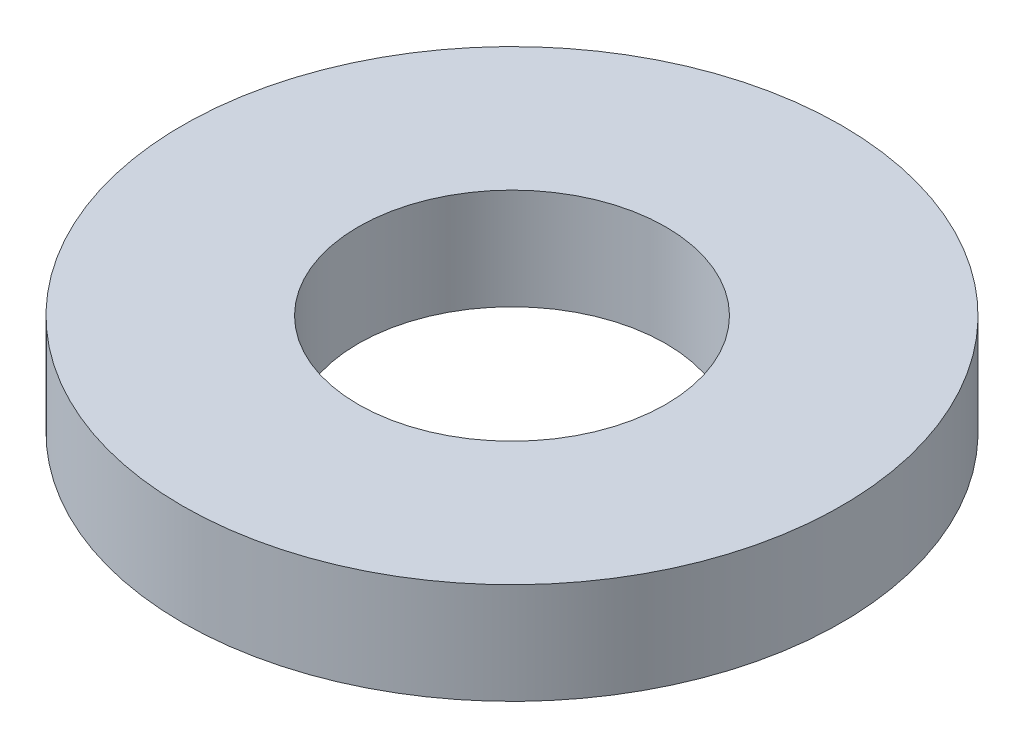
ISO-10303-21;
HEADER;
FILE_DESCRIPTION(('STEP AP214'),'2;1');
FILE_NAME('part.step','',(''),(''),'','','');
FILE_SCHEMA(('AUTOMOTIVE_DESIGN { 1 0 10303 214 1 1 1 1 }'));
ENDSEC;
DATA;
#1=APPLICATION_CONTEXT('core data for automotive mechanical design processes');
#2=APPLICATION_PROTOCOL_DEFINITION('international standard','automotive_design',2000,#1);
#3=PRODUCT_CONTEXT('',#1,'mechanical');
#4=PRODUCT('Part','Part','',(#3));
#5=PRODUCT_RELATED_PRODUCT_CATEGORY('part','',(#4));
#6=PRODUCT_DEFINITION_FORMATION('','',#4);
#7=PRODUCT_DEFINITION_CONTEXT('part definition',#1,'design');
#8=PRODUCT_DEFINITION('design','',#6,#7);
#9=PRODUCT_DEFINITION_SHAPE('','',#8);
#10=(LENGTH_UNIT() NAMED_UNIT(*) SI_UNIT(.MILLI.,.METRE.));
#11=(NAMED_UNIT(*) PLANE_ANGLE_UNIT() SI_UNIT($,.RADIAN.));
#12=(NAMED_UNIT(*) SI_UNIT($,.STERADIAN.) SOLID_ANGLE_UNIT());
#13=UNCERTAINTY_MEASURE_WITH_UNIT(LENGTH_MEASURE(1.E-05),#10,'distance_accuracy_value','');
#14=(GEOMETRIC_REPRESENTATION_CONTEXT(3) GLOBAL_UNCERTAINTY_ASSIGNED_CONTEXT((#13)) GLOBAL_UNIT_ASSIGNED_CONTEXT((#10,
#11,#12)) REPRESENTATION_CONTEXT('',''));
#15=CARTESIAN_POINT('',(0.,0.,0.));
#16=DIRECTION('',(0.,0.,1.));
#17=DIRECTION('',(1.,0.,0.));
#18=AXIS2_PLACEMENT_3D('',#15,#16,#17);
#19=CARTESIAN_POINT('',(0.,23.,0.));
#20=DIRECTION('',(0.,-1.,0.));
#21=DIRECTION('',(0.,0.,-1.));
#22=AXIS2_PLACEMENT_3D('',#19,#20,#21);
#23=CYLINDRICAL_SURFACE('',#22,75.);
#24=CARTESIAN_POINT('',(0.,23.,0.));
#25=DIRECTION('',(0.,1.,0.));
#26=DIRECTION('',(0.,0.,1.));
#27=AXIS2_PLACEMENT_3D('',#24,#25,#26);
#28=CIRCLE('',#27,75.);
#29=CARTESIAN_POINT('',(0.,23.,75.));
#30=VERTEX_POINT('',#29);
#31=EDGE_CURVE('E10',#30,#30,#28,.T.);
#32=ORIENTED_EDGE('',*,*,#31,.F.);
#33=EDGE_LOOP('',(#32));
#34=FACE_BOUND('',#33,.T.);
#35=CARTESIAN_POINT('',(0.,0.,0.));
#36=DIRECTION('',(0.,1.,0.));
#37=DIRECTION('',(0.,0.,1.));
#38=AXIS2_PLACEMENT_3D('',#35,#36,#37);
#39=CIRCLE('',#38,75.);
#40=CARTESIAN_POINT('',(0.,0.,75.));
#41=VERTEX_POINT('',#40);
#42=EDGE_CURVE('E37',#41,#41,#39,.T.);
#43=ORIENTED_EDGE('',*,*,#42,.T.);
#44=EDGE_LOOP('',(#43));
#45=FACE_BOUND('',#44,.T.);
#46=ADVANCED_FACE('F40',(#34,#45),#23,.T.);
#47=CARTESIAN_POINT('',(0.,23.,0.));
#48=DIRECTION('',(0.,1.,0.));
#49=DIRECTION('',(0.,0.,1.));
#50=AXIS2_PLACEMENT_3D('',#47,#48,#49);
#51=PLANE('',#50);
#52=CARTESIAN_POINT('',(0.,23.,0.));
#53=DIRECTION('',(0.,1.,0.));
#54=DIRECTION('',(0.,0.,1.));
#55=AXIS2_PLACEMENT_3D('',#52,#53,#54);
#56=CIRCLE('',#55,35.);
#57=CARTESIAN_POINT('',(0.,23.,35.));
#58=VERTEX_POINT('',#57);
#59=EDGE_CURVE('E50',#58,#58,#56,.T.);
#60=ORIENTED_EDGE('',*,*,#59,.F.);
#61=EDGE_LOOP('',(#60));
#62=FACE_BOUND('',#61,.T.);
#63=ORIENTED_EDGE('',*,*,#31,.T.);
#64=EDGE_LOOP('',(#63));
#65=FACE_BOUND('',#64,.T.);
#66=ADVANCED_FACE('F59',(#62,#65),#51,.T.);
#67=CARTESIAN_POINT('',(0.,0.,0.));
#68=DIRECTION('',(0.,1.,0.));
#69=DIRECTION('',(0.,0.,1.));
#70=AXIS2_PLACEMENT_3D('',#67,#68,#69);
#71=PLANE('',#70);
#72=CARTESIAN_POINT('',(0.,0.,0.));
#73=DIRECTION('',(0.,1.,0.));
#74=DIRECTION('',(0.,0.,1.));
#75=AXIS2_PLACEMENT_3D('',#72,#73,#74);
#76=CIRCLE('',#75,35.);
#77=CARTESIAN_POINT('',(0.,0.,35.));
#78=VERTEX_POINT('',#77);
#79=EDGE_CURVE('E47',#78,#78,#76,.T.);
#80=ORIENTED_EDGE('',*,*,#79,.T.);
#81=EDGE_LOOP('',(#80));
#82=FACE_BOUND('',#81,.T.);
#83=ORIENTED_EDGE('',*,*,#42,.F.);
#84=EDGE_LOOP('',(#83));
#85=FACE_BOUND('',#84,.T.);
#86=ADVANCED_FACE('F58',(#82,#85),#71,.F.);
#87=CARTESIAN_POINT('',(0.,23.,0.));
#88=DIRECTION('',(0.,-1.,0.));
#89=DIRECTION('',(0.,0.,-1.));
#90=AXIS2_PLACEMENT_3D('',#87,#88,#89);
#91=CYLINDRICAL_SURFACE('',#90,35.);
#92=ORIENTED_EDGE('',*,*,#59,.T.);
#93=EDGE_LOOP('',(#92));
#94=FACE_BOUND('',#93,.T.);
#95=ORIENTED_EDGE('',*,*,#79,.F.);
#96=EDGE_LOOP('',(#95));
#97=FACE_BOUND('',#96,.T.);
#98=ADVANCED_FACE('F54',(#94,#97),#91,.F.);
#99=CLOSED_SHELL('',(#46,#66,#86,#98));
#100=MANIFOLD_SOLID_BREP('B2',#99);
#101=ADVANCED_BREP_SHAPE_REPRESENTATION('',(#18,#100),#14);
#102=SHAPE_DEFINITION_REPRESENTATION(#9,#101);
ENDSEC;
END-ISO-10303-21;
